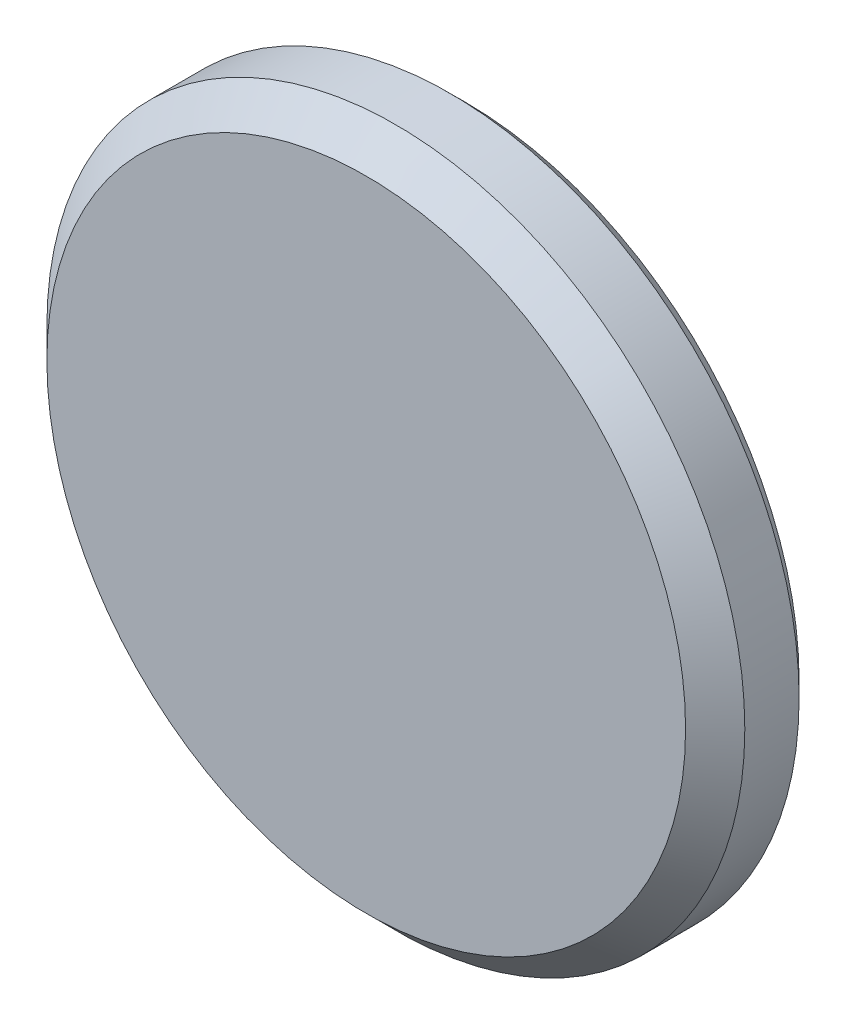
ISO-10303-21;
HEADER;
FILE_DESCRIPTION(('STEP AP214'),'2;1');
FILE_NAME('part.step','',(''),(''),'','','');
FILE_SCHEMA(('AUTOMOTIVE_DESIGN { 1 0 10303 214 1 1 1 1 }'));
ENDSEC;
DATA;
#1=APPLICATION_CONTEXT('core data for automotive mechanical design processes');
#2=APPLICATION_PROTOCOL_DEFINITION('international standard','automotive_design',2000,#1);
#3=PRODUCT_CONTEXT('',#1,'mechanical');
#4=PRODUCT('Part','Part','',(#3));
#5=PRODUCT_RELATED_PRODUCT_CATEGORY('part','',(#4));
#6=PRODUCT_DEFINITION_FORMATION('','',#4);
#7=PRODUCT_DEFINITION_CONTEXT('part definition',#1,'design');
#8=PRODUCT_DEFINITION('design','',#6,#7);
#9=PRODUCT_DEFINITION_SHAPE('','',#8);
#10=(LENGTH_UNIT() NAMED_UNIT(*) SI_UNIT(.MILLI.,.METRE.));
#11=(NAMED_UNIT(*) PLANE_ANGLE_UNIT() SI_UNIT($,.RADIAN.));
#12=(NAMED_UNIT(*) SI_UNIT($,.STERADIAN.) SOLID_ANGLE_UNIT());
#13=UNCERTAINTY_MEASURE_WITH_UNIT(LENGTH_MEASURE(1.E-05),#10,'distance_accuracy_value','');
#14=(GEOMETRIC_REPRESENTATION_CONTEXT(3) GLOBAL_UNCERTAINTY_ASSIGNED_CONTEXT((#13)) GLOBAL_UNIT_ASSIGNED_CONTEXT((#10,
#11,#12)) REPRESENTATION_CONTEXT('',''));
#15=CARTESIAN_POINT('',(0.,0.,0.));
#16=DIRECTION('',(0.,0.,1.));
#17=DIRECTION('',(1.,0.,0.));
#18=AXIS2_PLACEMENT_3D('',#15,#16,#17);
#19=CARTESIAN_POINT('',(0.,0.,2.54));
#20=DIRECTION('',(0.,0.,1.));
#21=DIRECTION('',(1.,0.,0.));
#22=AXIS2_PLACEMENT_3D('',#19,#20,#21);
#23=PLANE('',#22);
#24=CARTESIAN_POINT('',(0.,0.,2.54));
#25=DIRECTION('',(0.,0.,-1.));
#26=DIRECTION('',(-1.,0.,0.));
#27=AXIS2_PLACEMENT_3D('',#24,#25,#26);
#28=CIRCLE('',#27,8.2169);
#29=CARTESIAN_POINT('',(-8.2169,0.,2.54));
#30=VERTEX_POINT('',#29);
#31=EDGE_CURVE('E17',#30,#30,#28,.T.);
#32=ORIENTED_EDGE('',*,*,#31,.F.);
#33=EDGE_LOOP('',(#32));
#34=FACE_BOUND('',#33,.T.);
#35=ADVANCED_FACE('F14',(#34),#23,.T.);
#36=CARTESIAN_POINT('',(0.,0.,1.778));
#37=DIRECTION('',(0.,0.,-1.));
#38=DIRECTION('',(-1.,0.,0.));
#39=AXIS2_PLACEMENT_3D('',#36,#37,#38);
#40=CONICAL_SURFACE('',#39,8.9789,0.785398163397446);
#41=ORIENTED_EDGE('',*,*,#31,.T.);
#42=EDGE_LOOP('',(#41));
#43=FACE_BOUND('',#42,.T.);
#44=CARTESIAN_POINT('',(0.,0.,1.778));
#45=DIRECTION('',(0.,0.,-1.));
#46=DIRECTION('',(-1.,0.,0.));
#47=AXIS2_PLACEMENT_3D('',#44,#45,#46);
#48=CIRCLE('',#47,8.9789);
#49=CARTESIAN_POINT('',(-8.9789,0.,1.778));
#50=VERTEX_POINT('',#49);
#51=EDGE_CURVE('E25',#50,#50,#48,.T.);
#52=ORIENTED_EDGE('',*,*,#51,.F.);
#53=EDGE_LOOP('',(#52));
#54=FACE_BOUND('',#53,.T.);
#55=ADVANCED_FACE('F34',(#43,#54),#40,.T.);
#56=CARTESIAN_POINT('',(0.,0.,2.54));
#57=DIRECTION('',(0.,0.,-1.));
#58=DIRECTION('',(-1.,0.,0.));
#59=AXIS2_PLACEMENT_3D('',#56,#57,#58);
#60=CYLINDRICAL_SURFACE('',#59,8.9789);
#61=ORIENTED_EDGE('',*,*,#51,.T.);
#62=EDGE_LOOP('',(#61));
#63=FACE_BOUND('',#62,.T.);
#64=CARTESIAN_POINT('',(0.,0.,0.380999999999999));
#65=DIRECTION('',(0.,0.,1.));
#66=DIRECTION('',(1.,0.,0.));
#67=AXIS2_PLACEMENT_3D('',#64,#65,#66);
#68=CIRCLE('',#67,8.9789);
#69=CARTESIAN_POINT('',(8.9789,0.,0.380999999999999));
#70=VERTEX_POINT('',#69);
#71=EDGE_CURVE('E21',#70,#70,#68,.F.);
#72=ORIENTED_EDGE('',*,*,#71,.F.);
#73=EDGE_LOOP('',(#72));
#74=FACE_BOUND('',#73,.T.);
#75=ADVANCED_FACE('F42',(#63,#74),#60,.T.);
#76=CARTESIAN_POINT('',(0.,0.,0.380999999999999));
#77=DIRECTION('',(0.,0.,1.));
#78=DIRECTION('',(1.,0.,0.));
#79=AXIS2_PLACEMENT_3D('',#76,#77,#78);
#80=CONICAL_SURFACE('',#79,8.9789,0.785398163397451);
#81=CARTESIAN_POINT('',(0.,0.,0.));
#82=DIRECTION('',(0.,0.,1.));
#83=DIRECTION('',(1.,0.,0.));
#84=AXIS2_PLACEMENT_3D('',#81,#82,#83);
#85=CIRCLE('',#84,8.5979);
#86=CARTESIAN_POINT('',(8.5979,0.,0.));
#87=VERTEX_POINT('',#86);
#88=EDGE_CURVE('E9',#87,#87,#85,.T.);
#89=ORIENTED_EDGE('',*,*,#88,.T.);
#90=EDGE_LOOP('',(#89));
#91=FACE_BOUND('',#90,.T.);
#92=ORIENTED_EDGE('',*,*,#71,.T.);
#93=EDGE_LOOP('',(#92));
#94=FACE_BOUND('',#93,.T.);
#95=ADVANCED_FACE('F45',(#91,#94),#80,.T.);
#96=CARTESIAN_POINT('',(0.,0.,0.));
#97=DIRECTION('',(0.,0.,1.));
#98=DIRECTION('',(1.,0.,0.));
#99=AXIS2_PLACEMENT_3D('',#96,#97,#98);
#100=PLANE('',#99);
#101=ORIENTED_EDGE('',*,*,#88,.F.);
#102=EDGE_LOOP('',(#101));
#103=FACE_BOUND('',#102,.T.);
#104=ADVANCED_FACE('F43',(#103),#100,.F.);
#105=CLOSED_SHELL('',(#35,#55,#75,#95,#104));
#106=MANIFOLD_SOLID_BREP('B1',#105);
#107=ADVANCED_BREP_SHAPE_REPRESENTATION('',(#18,#106),#14);
#108=SHAPE_DEFINITION_REPRESENTATION(#9,#107);
ENDSEC;
END-ISO-10303-21;
